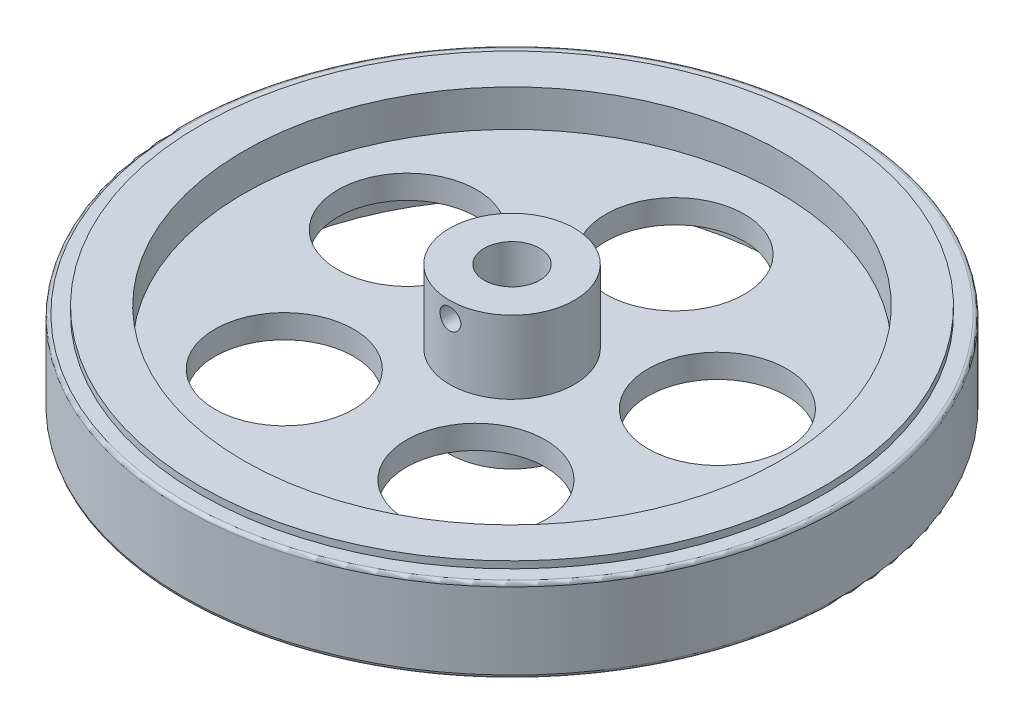
ISO-10303-21;
HEADER;
FILE_DESCRIPTION(('STEP AP214'),'2;1');
FILE_NAME('part.step','',(''),(''),'','','');
FILE_SCHEMA(('AUTOMOTIVE_DESIGN { 1 0 10303 214 1 1 1 1 }'));
ENDSEC;
DATA;
#1=APPLICATION_CONTEXT('core data for automotive mechanical design processes');
#2=APPLICATION_PROTOCOL_DEFINITION('international standard','automotive_design',2000,#1);
#3=PRODUCT_CONTEXT('',#1,'mechanical');
#4=PRODUCT('Part','Part','',(#3));
#5=PRODUCT_RELATED_PRODUCT_CATEGORY('part','',(#4));
#6=PRODUCT_DEFINITION_FORMATION('','',#4);
#7=PRODUCT_DEFINITION_CONTEXT('part definition',#1,'design');
#8=PRODUCT_DEFINITION('design','',#6,#7);
#9=PRODUCT_DEFINITION_SHAPE('','',#8);
#10=(LENGTH_UNIT() NAMED_UNIT(*) SI_UNIT(.MILLI.,.METRE.));
#11=(NAMED_UNIT(*) PLANE_ANGLE_UNIT() SI_UNIT($,.RADIAN.));
#12=(NAMED_UNIT(*) SI_UNIT($,.STERADIAN.) SOLID_ANGLE_UNIT());
#13=UNCERTAINTY_MEASURE_WITH_UNIT(LENGTH_MEASURE(1.E-05),#10,'distance_accuracy_value','');
#14=(GEOMETRIC_REPRESENTATION_CONTEXT(3) GLOBAL_UNCERTAINTY_ASSIGNED_CONTEXT((#13)) GLOBAL_UNIT_ASSIGNED_CONTEXT((#10,
#11,#12)) REPRESENTATION_CONTEXT('',''));
#15=CARTESIAN_POINT('',(0.,0.,0.));
#16=DIRECTION('',(0.,0.,1.));
#17=DIRECTION('',(1.,0.,0.));
#18=AXIS2_PLACEMENT_3D('',#15,#16,#17);
#19=CARTESIAN_POINT('',(0.,7.,0.));
#20=DIRECTION('',(0.,-1.,0.));
#21=DIRECTION('',(0.,0.,-1.));
#22=AXIS2_PLACEMENT_3D('',#19,#20,#21);
#23=CYLINDRICAL_SURFACE('',#22,4.);
#24=CARTESIAN_POINT('',(0.,12.2,0.));
#25=DIRECTION('',(0.,1.,0.));
#26=DIRECTION('',(0.,0.,1.));
#27=AXIS2_PLACEMENT_3D('',#24,#25,#26);
#28=CIRCLE('',#27,4.);
#29=CARTESIAN_POINT('',(0.,12.2,4.));
#30=VERTEX_POINT('',#29);
#31=EDGE_CURVE('E127',#30,#30,#28,.T.);
#32=ORIENTED_EDGE('',*,*,#31,.T.);
#33=EDGE_LOOP('',(#32));
#34=FACE_BOUND('',#33,.T.);
#35=CARTESIAN_POINT('',(0.,-7.,0.));
#36=DIRECTION('',(0.,1.,0.));
#37=DIRECTION('',(0.,0.,1.));
#38=AXIS2_PLACEMENT_3D('',#35,#36,#37);
#39=CIRCLE('',#38,4.);
#40=CARTESIAN_POINT('',(0.,-7.,4.));
#41=VERTEX_POINT('',#40);
#42=EDGE_CURVE('E58',#41,#41,#39,.T.);
#43=ORIENTED_EDGE('',*,*,#42,.F.);
#44=EDGE_LOOP('',(#43));
#45=FACE_BOUND('',#44,.T.);
#46=CARTESIAN_POINT('',(-1.5,9.9,3.70809924354783));
#47=CARTESIAN_POINT('',(-1.50000304106109,9.81899251627921,3.70809640633806));
#48=CARTESIAN_POINT('',(-1.49341597549487,9.73800507749636,3.71078260240986));
#49=CARTESIAN_POINT('',(-1.46736187895468,9.5784719170868,3.72116159304967));
#50=CARTESIAN_POINT('',(-1.44789523373263,9.49992612240499,3.72885423767112));
#51=CARTESIAN_POINT('',(-1.39689657610574,9.34762462838647,3.748254802809));
#52=CARTESIAN_POINT('',(-1.36539347266348,9.27385794334892,3.7599530956926));
#53=CARTESIAN_POINT('',(-1.29131856742698,9.13262810318116,3.78603134206598));
#54=CARTESIAN_POINT('',(-1.24874344095039,9.06516684971748,3.80041210067323));
#55=CARTESIAN_POINT('',(-1.15146661374162,8.93510968837718,3.83103574665713));
#56=CARTESIAN_POINT('',(-1.09630381213306,8.8728714703706,3.84733341923603));
#57=CARTESIAN_POINT('',(-0.976395839778926,8.75827718532851,3.87949750628547));
#58=CARTESIAN_POINT('',(-0.911648630256679,8.70592322625814,3.89536382814785));
#59=CARTESIAN_POINT('',(-0.771694655177599,8.61086048770439,3.92552873936553));
#60=CARTESIAN_POINT('',(-0.696206947538027,8.56854052528414,3.93975561223505));
#61=CARTESIAN_POINT('',(-0.538555771965247,8.49734882747509,3.96438007973848));
#62=CARTESIAN_POINT('',(-0.456394630933535,8.46847242800802,3.97477900217006));
#63=CARTESIAN_POINT('',(-0.291489341676832,8.42624210422538,3.9901869710344));
#64=CARTESIAN_POINT('',(-0.208923197281596,8.41227237255954,3.99540915214774));
#65=CARTESIAN_POINT('',(-0.0424643637947861,8.39827879905501,4.0006401410794));
#66=CARTESIAN_POINT('',(0.0414278850628329,8.39825042238129,4.00065064414902));
#67=CARTESIAN_POINT('',(0.203743543064476,8.41178176146517,3.99559265903894));
#68=CARTESIAN_POINT('',(0.2822321782669,8.42466929794881,3.99077541996683));
#69=CARTESIAN_POINT('',(0.435839217984391,8.46253591522555,3.97693274932263));
#70=CARTESIAN_POINT('',(0.510957383430298,8.48751585226204,3.96790701975578));
#71=CARTESIAN_POINT('',(0.656989017303104,8.54917045167585,3.94637769167531));
#72=CARTESIAN_POINT('',(0.727825392287309,8.58601000526841,3.93382539470077));
#73=CARTESIAN_POINT('',(0.862486607957559,8.67019209692939,3.90651310225279));
#74=CARTESIAN_POINT('',(0.926309176932323,8.7175380230176,3.8917523951284));
#75=CARTESIAN_POINT('',(1.04909048680094,8.82462728628319,3.86052529655816));
#76=CARTESIAN_POINT('',(1.10754614526348,8.88493391565043,3.84400963763883));
#77=CARTESIAN_POINT('',(1.21370395569342,9.01459299332156,3.81182460645722));
#78=CARTESIAN_POINT('',(1.261403406929,9.08394770658664,3.79615544748847));
#79=CARTESIAN_POINT('',(1.34565611808151,9.23171946746282,3.76712703500335));
#80=CARTESIAN_POINT('',(1.38193847851831,9.31030349368607,3.75382677150277));
#81=CARTESIAN_POINT('',(1.44056464441501,9.47309622516757,3.73172438629002));
#82=CARTESIAN_POINT('',(1.46291620605595,9.55730177159369,3.72291976205783));
#83=CARTESIAN_POINT('',(1.49190191709668,9.72397596231595,3.71139597222848));
#84=CARTESIAN_POINT('',(1.49933521158966,9.80628410553614,3.70836785241537));
#85=CARTESIAN_POINT('',(1.50057885636272,9.97100935674174,3.70786539525016));
#86=CARTESIAN_POINT('',(1.49439261093762,10.0534264323525,3.71038967003987));
#87=CARTESIAN_POINT('',(1.46929733520157,10.2119299222877,3.72039381629735));
#88=CARTESIAN_POINT('',(1.45100618334225,10.2881311357647,3.72763276216449));
#89=CARTESIAN_POINT('',(1.40299774640638,10.4363479447202,3.74596487046362));
#90=CARTESIAN_POINT('',(1.37327812034623,10.5083626791681,3.75705882250173));
#91=CARTESIAN_POINT('',(1.30200292275278,10.6491644380762,3.7823624311608));
#92=CARTESIAN_POINT('',(1.26004545177047,10.7177292921373,3.79667328892065));
#93=CARTESIAN_POINT('',(1.16591317862479,10.847128981726,3.82662814294291));
#94=CARTESIAN_POINT('',(1.11373463696435,10.9079609746246,3.84227262594077));
#95=CARTESIAN_POINT('',(0.996727340900939,11.0241683731951,3.87433046553184));
#96=CARTESIAN_POINT('',(0.931306341491062,11.0789534087687,3.89072969357028));
#97=CARTESIAN_POINT('',(0.791797471753152,11.1768383675894,3.92149874963302));
#98=CARTESIAN_POINT('',(0.717709573322675,11.2199382529458,3.93586857107664));
#99=CARTESIAN_POINT('',(0.563016329468479,11.2929460561996,3.96094985704552));
#100=CARTESIAN_POINT('',(0.482434433064628,11.3228991237926,3.9716738133801));
#101=CARTESIAN_POINT('',(0.316881887523256,11.3686564138499,3.98829436712571));
#102=CARTESIAN_POINT('',(0.231913320723594,11.3844672854224,3.99419323299412));
#103=CARTESIAN_POINT('',(0.065335585273817,11.4007744027548,4.00028407317073));
#104=CARTESIAN_POINT('',(-0.016180768060844,11.402109483059,4.00078860953764));
#105=CARTESIAN_POINT('',(-0.178226786412422,11.3915848405546,3.99684889809224));
#106=CARTESIAN_POINT('',(-0.258756569245256,11.3797267091141,3.9924052471313));
#107=CARTESIAN_POINT('',(-0.414548248377124,11.3437411485064,3.97921089603771));
#108=CARTESIAN_POINT('',(-0.489890731068833,11.3199200941216,3.97056791378017));
#109=CARTESIAN_POINT('',(-0.635515473006388,11.2609899866156,3.9498778362099));
#110=CARTESIAN_POINT('',(-0.705796771275541,11.2258787966952,3.93783009655664));
#111=CARTESIAN_POINT('',(-0.842540176994411,11.1436860564952,3.91090618300074));
#112=CARTESIAN_POINT('',(-0.908717548846847,11.0961633594859,3.89593240108828));
#113=CARTESIAN_POINT('',(-1.03241734752336,10.9911921698124,3.86499507694844));
#114=CARTESIAN_POINT('',(-1.0899366712559,10.9337401341921,3.84903118274027));
#115=CARTESIAN_POINT('',(-1.19781214236195,10.8069358683549,3.81688129739175));
#116=CARTESIAN_POINT('',(-1.24762999816025,10.7371155978457,3.8007280534916));
#117=CARTESIAN_POINT('',(-1.33484709556843,10.5895841304267,3.77098325003638));
#118=CARTESIAN_POINT('',(-1.37224504878157,10.5118721159465,3.75739195631216));
#119=CARTESIAN_POINT('',(-1.4346588697426,10.3470443190246,3.73402269853266));
#120=CARTESIAN_POINT('',(-1.45906002899523,10.2596656334882,3.7244380329086));
#121=CARTESIAN_POINT('',(-1.49172356722079,10.0815147280442,3.71147994336315));
#122=CARTESIAN_POINT('',(-1.4999965933957,9.99074478729001,3.70810242179736));
#123=CARTESIAN_POINT('',(-1.5,9.9,3.70809924354783));
#124=B_SPLINE_CURVE_WITH_KNOTS('',3,(#46,#47,#48,#49,#50,#51,#52,#53,#54,#55,#56,#57,#58,#59,
#60,#61,#62,#63,#64,#65,#66,#67,#68,#69,#70,#71,#72,#73,#74,#75,#76,#77,#78,#79,#80,#81,#82,#83,
#84,#85,#86,#87,#88,#89,#90,#91,#92,#93,#94,#95,#96,#97,#98,#99,#100,#101,#102,#103,#104,#105,
#106,#107,#108,#109,#110,#111,#112,#113,#114,#115,#116,#117,#118,#119,#120,#121,#122,#123),
.UNSPECIFIED.,.T.,.F.,(4,2,2,2,2,2,2,2,2,2,2,2,2,2,2,2,2,2,2,2,2,2,2,2,2,2,2,2,2,2,2,2,2,2,2,2,
2,2,4),(0.,0.242684541416169,0.485361814598854,0.727459856757029,0.969630679682932,
1.22274652401128,1.47591628822983,1.73770072136421,1.9993942638133,2.24980018489679,
2.50012465404857,2.73806472803194,2.97602165263335,3.21744131210668,3.45893893628976,
3.71456675065874,3.97025867827334,4.23162592252966,4.49284751635474,4.73965657740485,
4.98640395388884,5.22143845928198,5.45652113429526,5.70041561005821,5.94439948466355,
6.20385016993624,6.46330169650177,6.72185508890168,6.98028685560126,7.22365720549936,
7.46699820319479,7.7044027400389,7.94185223512831,8.18928323676986,8.43680270894964,
8.69738599542079,8.95799630544242,9.23003178870926,9.50188762323053),.UNSPECIFIED.);
#125=CARTESIAN_POINT('',(-1.5,9.9,3.70809924354783));
#126=VERTEX_POINT('',#125);
#127=EDGE_CURVE('E130',#126,#126,#124,.T.);
#128=ORIENTED_EDGE('',*,*,#127,.T.);
#129=EDGE_LOOP('',(#128));
#130=FACE_BOUND('',#129,.T.);
#131=ADVANCED_FACE('F34',(#34,#45,#130),#23,.F.);
#132=CARTESIAN_POINT('',(0.,1.7,0.));
#133=DIRECTION('',(0.,1.,0.));
#134=DIRECTION('',(0.,0.,1.));
#135=AXIS2_PLACEMENT_3D('',#132,#133,#134);
#136=CYLINDRICAL_SURFACE('',#135,9.);
#137=CARTESIAN_POINT('',(0.,12.2,0.));
#138=DIRECTION('',(0.,1.,0.));
#139=DIRECTION('',(0.,0.,1.));
#140=AXIS2_PLACEMENT_3D('',#137,#138,#139);
#141=CIRCLE('',#140,9.);
#142=CARTESIAN_POINT('',(0.,12.2,9.));
#143=VERTEX_POINT('',#142);
#144=EDGE_CURVE('E117',#143,#143,#141,.T.);
#145=ORIENTED_EDGE('',*,*,#144,.F.);
#146=EDGE_LOOP('',(#145));
#147=FACE_BOUND('',#146,.T.);
#148=CARTESIAN_POINT('',(0.,1.7,0.));
#149=DIRECTION('',(0.,1.,0.));
#150=DIRECTION('',(0.,0.,1.));
#151=AXIS2_PLACEMENT_3D('',#148,#149,#150);
#152=CIRCLE('',#151,9.);
#153=CARTESIAN_POINT('',(0.,1.7,9.));
#154=VERTEX_POINT('',#153);
#155=EDGE_CURVE('E95',#154,#154,#152,.T.);
#156=ORIENTED_EDGE('',*,*,#155,.T.);
#157=EDGE_LOOP('',(#156));
#158=FACE_BOUND('',#157,.T.);
#159=CARTESIAN_POINT('',(0.,8.4,9.));
#160=CARTESIAN_POINT('',(-0.0836345429749289,8.40000335336869,8.99999856701294));
#161=CARTESIAN_POINT('',(-0.167314729103292,8.40701836498135,8.9988220674782));
#162=CARTESIAN_POINT('',(-0.332328133003826,8.4348813952592,8.99424206964832));
#163=CARTESIAN_POINT('',(-0.413659120775548,8.45574213414696,8.99083652354334));
#164=CARTESIAN_POINT('',(-0.571562848327586,8.51064926915565,8.9821804094187));
#165=CARTESIAN_POINT('',(-0.64813942105914,8.54468487938434,8.97693135095516));
#166=CARTESIAN_POINT('',(-0.794485105186767,8.62494737523144,8.96516536249242));
#167=CARTESIAN_POINT('',(-0.864254993927154,8.6711728664898,8.9586485775266));
#168=CARTESIAN_POINT('',(-0.995683568575008,8.77497305029228,8.94499990474988));
#169=CARTESIAN_POINT('',(-1.05726774212098,8.83264146878168,8.93786323088914));
#170=CARTESIAN_POINT('',(-1.16993309919596,8.95748878108368,8.92381576126039));
#171=CARTESIAN_POINT('',(-1.22101361963458,9.02466827487397,8.916904979776));
#172=CARTESIAN_POINT('',(-1.31152027536308,9.16714257971823,8.90404539455868));
#173=CARTESIAN_POINT('',(-1.3508727317166,9.24248480208285,8.89810277454982));
#174=CARTESIAN_POINT('',(-1.41633501924673,9.39882573858038,8.88791873876805));
#175=CARTESIAN_POINT('',(-1.44244574493937,9.47982407020658,8.88367720808584));
#176=CARTESIAN_POINT('',(-1.48044862667088,9.64438816491392,8.87742322105653));
#177=CARTESIAN_POINT('',(-1.49246941748124,9.72792344190083,8.8753906109142));
#178=CARTESIAN_POINT('',(-1.50235003517392,9.89584816613008,8.87372363361989));
#179=CARTESIAN_POINT('',(-1.5002108642334,9.98023755250038,8.87408909674328));
#180=CARTESIAN_POINT('',(-1.48193705903769,10.1465567167653,8.87715857318133));
#181=CARTESIAN_POINT('',(-1.46594692913386,10.2285028821271,8.8798384399135));
#182=CARTESIAN_POINT('',(-1.42065188424207,10.3885327906975,8.88719697126605));
#183=CARTESIAN_POINT('',(-1.39134651259184,10.4666164013331,8.89187570443963));
#184=CARTESIAN_POINT('',(-1.32010634765635,10.6171372940646,8.9027308760046));
#185=CARTESIAN_POINT('',(-1.27811154832783,10.6895456436487,8.90891440264395));
#186=CARTESIAN_POINT('',(-1.18272721053446,10.826342640323,8.92207751049005));
#187=CARTESIAN_POINT('',(-1.12933675239257,10.890730639473,8.92905715592572));
#188=CARTESIAN_POINT('',(-1.01188932729543,11.0104956514844,8.94313216727871));
#189=CARTESIAN_POINT('',(-0.947708378323875,11.065751111124,8.95022789538991));
#190=CARTESIAN_POINT('',(-0.810921149388987,11.1647266575992,8.96365560838034));
#191=CARTESIAN_POINT('',(-0.738314815143852,11.2084466701099,8.96998758833847));
#192=CARTESIAN_POINT('',(-0.586623549700026,11.2831213362818,8.98118335735747));
#193=CARTESIAN_POINT('',(-0.507533235338796,11.3140652515988,8.98604591044468));
#194=CARTESIAN_POINT('',(-0.345179007361638,11.3621965291476,8.99374501807596));
#195=CARTESIAN_POINT('',(-0.26191544350768,11.3793850421842,8.99658174210284));
#196=CARTESIAN_POINT('',(-0.0946259407809731,11.3993528150767,8.99988677905612));
#197=CARTESIAN_POINT('',(-0.0106204422906058,11.4022989430834,9.00038251807671));
#198=CARTESIAN_POINT('',(0.156683863733933,11.3941431933431,8.99902484652702));
#199=CARTESIAN_POINT('',(0.239982698335224,11.3830418561198,8.99717152634471));
#200=CARTESIAN_POINT('',(0.402993705328059,11.3472450903987,8.99134096162921));
#201=CARTESIAN_POINT('',(0.482724521031229,11.3226322749659,8.98737662880787));
#202=CARTESIAN_POINT('',(0.636928130916267,11.2605992890803,8.97776678673215));
#203=CARTESIAN_POINT('',(0.711400629545832,11.2231783994188,8.97212118307212));
#204=CARTESIAN_POINT('',(0.853698413681376,11.1362093251819,8.95970709781444));
#205=CARTESIAN_POINT('',(0.921459150562289,11.0865569062996,8.95292913532213));
#206=CARTESIAN_POINT('',(1.04774615130161,10.976677610769,8.93903080435141));
#207=CARTESIAN_POINT('',(1.10627174381795,10.916449966034,8.93191041102928));
#208=CARTESIAN_POINT('',(1.2130456677948,10.7863814711571,8.91804105141507));
#209=CARTESIAN_POINT('',(1.26118125666823,10.7164475006914,8.91129669682264));
#210=CARTESIAN_POINT('',(1.34502138617699,10.5693882185169,8.8990291786673));
#211=CARTESIAN_POINT('',(1.38072632086189,10.4922631348635,8.89350597639612));
#212=CARTESIAN_POINT('',(1.43852299888389,10.3333261603127,8.88434072218623));
#213=CARTESIAN_POINT('',(1.46067085952877,10.2515351429817,8.88069092586639));
#214=CARTESIAN_POINT('',(1.49090127226697,10.0853279224669,8.87566630101156));
#215=CARTESIAN_POINT('',(1.4989850471677,10.0009119481608,8.87429127469633));
#216=CARTESIAN_POINT('',(1.50082371962841,9.83297690042255,8.87398039850407));
#217=CARTESIAN_POINT('',(1.49475608167511,9.74945977285483,8.8750143390339));
#218=CARTESIAN_POINT('',(1.46884790337411,9.58465245116954,8.87933868872237));
#219=CARTESIAN_POINT('',(1.44900740766749,9.50336224983488,8.88262909056728));
#220=CARTESIAN_POINT('',(1.39618469375694,9.34538493762443,8.89108413769031));
#221=CARTESIAN_POINT('',(1.36321775436027,9.26869259396638,8.89624660331802));
#222=CARTESIAN_POINT('',(1.28509620234955,9.12189859848309,8.90786621353324));
#223=CARTESIAN_POINT('',(1.23994098524914,9.05179727377672,8.91432342233039));
#224=CARTESIAN_POINT('',(1.13809133062329,8.91927865013535,8.92790072427373));
#225=CARTESIAN_POINT('',(1.08126633815619,8.85696238997983,8.93502777345781));
#226=CARTESIAN_POINT('',(0.957965418828137,8.74268903731504,8.94908623416505));
#227=CARTESIAN_POINT('',(0.891487267747581,8.6907343388171,8.95601760015928));
#228=CARTESIAN_POINT('',(0.750221501784168,8.59833103908003,8.96895917785332));
#229=CARTESIAN_POINT('',(0.67537967251969,8.55796437641223,8.97496269751862));
#230=CARTESIAN_POINT('',(0.519907841627388,8.49043830923405,8.98530700561065));
#231=CARTESIAN_POINT('',(0.439283696898005,8.46326575135218,8.98964944906489));
#232=CARTESIAN_POINT('',(0.29862198602724,8.428796835524,8.99523474499773));
#233=CARTESIAN_POINT('',(0.239435298179069,8.41801531823042,8.99701216364015));
#234=CARTESIAN_POINT('',(0.120173586191886,8.40361575729315,8.99939529591672));
#235=CARTESIAN_POINT('',(0.0600985773650968,8.39999759031758,9.00000102972385));
#236=CARTESIAN_POINT('',(0.,8.4,9.));
#237=B_SPLINE_CURVE_WITH_KNOTS('',3,(#159,#160,#161,#162,#163,#164,#165,#166,#167,#168,#169,
#170,#171,#172,#173,#174,#175,#176,#177,#178,#179,#180,#181,#182,#183,#184,#185,#186,#187,#188,
#189,#190,#191,#192,#193,#194,#195,#196,#197,#198,#199,#200,#201,#202,#203,#204,#205,#206,#207,
#208,#209,#210,#211,#212,#213,#214,#215,#216,#217,#218,#219,#220,#221,#222,#223,#224,#225,#226,
#227,#228,#229,#230,#231,#232,#233,#234,#235,#236),.UNSPECIFIED.,.T.,.F.,(4,2,2,2,2,2,2,2,2,2,2,
2,2,2,2,2,2,2,2,2,2,2,2,2,2,2,2,2,2,2,2,2,2,2,2,2,2,2,4),(0.,0.250683950963106,
0.501598527417252,0.752308120215162,1.00298904760487,1.25581494637399,1.50865680101914,
1.76305512494304,2.01743626125709,2.26947646262054,2.52149882592532,2.77092313056245,
3.02035599015229,3.27098733979535,3.52163892408344,3.77539661946796,4.02915594981509,
4.28312813349542,4.53707906712689,4.78804730094838,5.03900587821516,5.28844684203849,
5.5379018149564,5.78956095376214,6.0412383783257,6.29552293204571,6.54979942425566,
6.80301613405063,7.05621082671971,7.3062474571362,7.5562832771288,7.80602890935733,
8.05578693017602,8.30850830516035,8.56128800327383,8.8158133896432,9.07008451278043,
9.25022548898411,9.43036336366181),.UNSPECIFIED.);
#238=CARTESIAN_POINT('',(0.,8.4,9.));
#239=VERTEX_POINT('',#238);
#240=EDGE_CURVE('E38',#239,#239,#237,.T.);
#241=ORIENTED_EDGE('',*,*,#240,.T.);
#242=EDGE_LOOP('',(#241));
#243=FACE_BOUND('',#242,.T.);
#244=ADVANCED_FACE('F181',(#147,#158,#243),#136,.T.);
#245=CARTESIAN_POINT('',(0.,-7.,0.));
#246=DIRECTION('',(0.,1.,0.));
#247=DIRECTION('',(0.,0.,1.));
#248=AXIS2_PLACEMENT_3D('',#245,#246,#247);
#249=PLANE('',#248);
#250=ORIENTED_EDGE('',*,*,#42,.T.);
#251=EDGE_LOOP('',(#250));
#252=FACE_BOUND('',#251,.T.);
#253=CARTESIAN_POINT('',(0.,-7.,0.));
#254=DIRECTION('',(0.,1.,0.));
#255=DIRECTION('',(0.,0.,1.));
#256=AXIS2_PLACEMENT_3D('',#253,#254,#255);
#257=CIRCLE('',#256,9.);
#258=CARTESIAN_POINT('',(0.,-7.,9.));
#259=VERTEX_POINT('',#258);
#260=EDGE_CURVE('E76',#259,#259,#257,.T.);
#261=ORIENTED_EDGE('',*,*,#260,.F.);
#262=EDGE_LOOP('',(#261));
#263=FACE_BOUND('',#262,.T.);
#264=ADVANCED_FACE('F185',(#252,#263),#249,.F.);
#265=CARTESIAN_POINT('',(0.,7.,0.));
#266=DIRECTION('',(0.,-1.,0.));
#267=DIRECTION('',(0.,0.,-1.));
#268=AXIS2_PLACEMENT_3D('',#265,#266,#267);
#269=CYLINDRICAL_SURFACE('',#268,47.5);
#270=CARTESIAN_POINT('',(0.,-5.5,0.));
#271=DIRECTION('',(0.,-1.,0.));
#272=DIRECTION('',(0.,0.,-1.));
#273=AXIS2_PLACEMENT_3D('',#270,#271,#272);
#274=CIRCLE('',#273,47.5);
#275=CARTESIAN_POINT('',(0.,-5.5,-47.5));
#276=VERTEX_POINT('',#275);
#277=EDGE_CURVE('E50',#276,#276,#274,.F.);
#278=ORIENTED_EDGE('',*,*,#277,.T.);
#279=EDGE_LOOP('',(#278));
#280=FACE_BOUND('',#279,.T.);
#281=CARTESIAN_POINT('',(0.,5.5,0.));
#282=DIRECTION('',(0.,1.,0.));
#283=DIRECTION('',(0.,0.,1.));
#284=AXIS2_PLACEMENT_3D('',#281,#282,#283);
#285=CIRCLE('',#284,47.5);
#286=CARTESIAN_POINT('',(0.,5.5,47.5));
#287=VERTEX_POINT('',#286);
#288=EDGE_CURVE('E55',#287,#287,#285,.F.);
#289=ORIENTED_EDGE('',*,*,#288,.T.);
#290=EDGE_LOOP('',(#289));
#291=FACE_BOUND('',#290,.T.);
#292=ADVANCED_FACE('F214',(#280,#291),#269,.T.);
#293=CARTESIAN_POINT('',(0.,-7.,0.));
#294=DIRECTION('',(0.,1.,0.));
#295=DIRECTION('',(0.,0.,1.));
#296=AXIS2_PLACEMENT_3D('',#293,#294,#295);
#297=CIRCLE('',#296,38.66);
#298=CARTESIAN_POINT('',(0.,-7.,38.66));
#299=VERTEX_POINT('',#298);
#300=EDGE_CURVE('E101',#299,#299,#297,.T.);
#301=ORIENTED_EDGE('',*,*,#300,.T.);
#302=EDGE_LOOP('',(#301));
#303=FACE_BOUND('',#302,.T.);
#304=CARTESIAN_POINT('',(0.,-7.,0.));
#305=DIRECTION('',(0.,1.,0.));
#306=DIRECTION('',(0.,0.,1.));
#307=AXIS2_PLACEMENT_3D('',#304,#305,#306);
#308=CIRCLE('',#307,45.);
#309=CARTESIAN_POINT('',(0.,-7.,45.));
#310=VERTEX_POINT('',#309);
#311=EDGE_CURVE('E86',#310,#310,#308,.T.);
#312=ORIENTED_EDGE('',*,*,#311,.F.);
#313=EDGE_LOOP('',(#312));
#314=FACE_BOUND('',#313,.T.);
#315=ADVANCED_FACE('F211',(#303,#314),#249,.F.);
#316=CARTESIAN_POINT('',(0.,7.,0.));
#317=DIRECTION('',(0.,1.,0.));
#318=DIRECTION('',(0.,0.,1.));
#319=AXIS2_PLACEMENT_3D('',#316,#317,#318);
#320=PLANE('',#319);
#321=CARTESIAN_POINT('',(0.,7.,0.));
#322=DIRECTION('',(0.,1.,0.));
#323=DIRECTION('',(0.,0.,1.));
#324=AXIS2_PLACEMENT_3D('',#321,#322,#323);
#325=CIRCLE('',#324,38.66);
#326=CARTESIAN_POINT('',(0.,7.,38.66));
#327=VERTEX_POINT('',#326);
#328=EDGE_CURVE('E92',#327,#327,#325,.T.);
#329=ORIENTED_EDGE('',*,*,#328,.F.);
#330=EDGE_LOOP('',(#329));
#331=FACE_BOUND('',#330,.T.);
#332=CARTESIAN_POINT('',(0.,7.,0.));
#333=DIRECTION('',(0.,1.,0.));
#334=DIRECTION('',(0.,0.,1.));
#335=AXIS2_PLACEMENT_3D('',#332,#333,#334);
#336=CIRCLE('',#335,45.);
#337=CARTESIAN_POINT('',(0.,7.,45.));
#338=VERTEX_POINT('',#337);
#339=EDGE_CURVE('E80',#338,#338,#336,.T.);
#340=ORIENTED_EDGE('',*,*,#339,.T.);
#341=EDGE_LOOP('',(#340));
#342=FACE_BOUND('',#341,.T.);
#343=ADVANCED_FACE('F209',(#331,#342),#320,.T.);
#344=CARTESIAN_POINT('',(0.,6.,0.));
#345=DIRECTION('',(0.,1.,0.));
#346=DIRECTION('',(0.,0.,1.));
#347=AXIS2_PLACEMENT_3D('',#344,#345,#346);
#348=PLANE('',#347);
#349=CARTESIAN_POINT('',(0.,6.,0.));
#350=DIRECTION('',(0.,1.,0.));
#351=DIRECTION('',(0.,0.,1.));
#352=AXIS2_PLACEMENT_3D('',#349,#350,#351);
#353=CIRCLE('',#352,47.);
#354=CARTESIAN_POINT('',(0.,6.,47.));
#355=VERTEX_POINT('',#354);
#356=EDGE_CURVE('E10',#355,#355,#353,.T.);
#357=ORIENTED_EDGE('',*,*,#356,.T.);
#358=EDGE_LOOP('',(#357));
#359=FACE_BOUND('',#358,.T.);
#360=CARTESIAN_POINT('',(0.,6.,0.));
#361=DIRECTION('',(0.,1.,0.));
#362=DIRECTION('',(0.,0.,1.));
#363=AXIS2_PLACEMENT_3D('',#360,#361,#362);
#364=CIRCLE('',#363,45.);
#365=CARTESIAN_POINT('',(0.,6.,45.));
#366=VERTEX_POINT('',#365);
#367=EDGE_CURVE('E79',#366,#366,#364,.T.);
#368=ORIENTED_EDGE('',*,*,#367,.F.);
#369=EDGE_LOOP('',(#368));
#370=FACE_BOUND('',#369,.T.);
#371=ADVANCED_FACE('F205',(#359,#370),#348,.T.);
#372=CARTESIAN_POINT('',(0.,6.,0.));
#373=DIRECTION('',(0.,1.,0.));
#374=DIRECTION('',(0.,0.,1.));
#375=AXIS2_PLACEMENT_3D('',#372,#373,#374);
#376=CYLINDRICAL_SURFACE('',#375,45.);
#377=ORIENTED_EDGE('',*,*,#367,.T.);
#378=EDGE_LOOP('',(#377));
#379=FACE_BOUND('',#378,.T.);
#380=ORIENTED_EDGE('',*,*,#339,.F.);
#381=EDGE_LOOP('',(#380));
#382=FACE_BOUND('',#381,.T.);
#383=ADVANCED_FACE('F201',(#379,#382),#376,.T.);
#384=CARTESIAN_POINT('',(0.,-6.,0.));
#385=DIRECTION('',(0.,-1.,0.));
#386=DIRECTION('',(0.,0.,1.));
#387=AXIS2_PLACEMENT_3D('',#384,#385,#386);
#388=PLANE('',#387);
#389=CARTESIAN_POINT('',(0.,-6.,0.));
#390=DIRECTION('',(0.,-1.,0.));
#391=DIRECTION('',(0.,0.,-1.));
#392=AXIS2_PLACEMENT_3D('',#389,#390,#391);
#393=CIRCLE('',#392,47.);
#394=CARTESIAN_POINT('',(0.,-6.,-47.));
#395=VERTEX_POINT('',#394);
#396=EDGE_CURVE('E46',#395,#395,#393,.T.);
#397=ORIENTED_EDGE('',*,*,#396,.T.);
#398=EDGE_LOOP('',(#397));
#399=FACE_BOUND('',#398,.T.);
#400=CARTESIAN_POINT('',(0.,-6.,0.));
#401=DIRECTION('',(0.,1.,0.));
#402=DIRECTION('',(0.,0.,1.));
#403=AXIS2_PLACEMENT_3D('',#400,#401,#402);
#404=CIRCLE('',#403,45.);
#405=CARTESIAN_POINT('',(0.,-6.,45.));
#406=VERTEX_POINT('',#405);
#407=EDGE_CURVE('E83',#406,#406,#404,.T.);
#408=ORIENTED_EDGE('',*,*,#407,.T.);
#409=EDGE_LOOP('',(#408));
#410=FACE_BOUND('',#409,.T.);
#411=ADVANCED_FACE('F197',(#399,#410),#388,.T.);
#412=CARTESIAN_POINT('',(0.,-6.,0.));
#413=DIRECTION('',(0.,-1.,0.));
#414=DIRECTION('',(0.,0.,-1.));
#415=AXIS2_PLACEMENT_3D('',#412,#413,#414);
#416=CYLINDRICAL_SURFACE('',#415,45.);
#417=ORIENTED_EDGE('',*,*,#407,.F.);
#418=EDGE_LOOP('',(#417));
#419=FACE_BOUND('',#418,.T.);
#420=ORIENTED_EDGE('',*,*,#311,.T.);
#421=EDGE_LOOP('',(#420));
#422=FACE_BOUND('',#421,.T.);
#423=ADVANCED_FACE('F193',(#419,#422),#416,.T.);
#424=CARTESIAN_POINT('',(0.,1.7,0.));
#425=DIRECTION('',(0.,1.,0.));
#426=DIRECTION('',(0.,0.,1.));
#427=AXIS2_PLACEMENT_3D('',#424,#425,#426);
#428=CYLINDRICAL_SURFACE('',#427,38.66);
#429=CARTESIAN_POINT('',(0.,1.7,0.));
#430=DIRECTION('',(0.,1.,0.));
#431=DIRECTION('',(0.,0.,1.));
#432=AXIS2_PLACEMENT_3D('',#429,#430,#431);
#433=CIRCLE('',#432,38.66);
#434=CARTESIAN_POINT('',(0.,1.7,38.66));
#435=VERTEX_POINT('',#434);
#436=EDGE_CURVE('E89',#435,#435,#433,.T.);
#437=ORIENTED_EDGE('',*,*,#436,.F.);
#438=EDGE_LOOP('',(#437));
#439=FACE_BOUND('',#438,.T.);
#440=ORIENTED_EDGE('',*,*,#328,.T.);
#441=EDGE_LOOP('',(#440));
#442=FACE_BOUND('',#441,.T.);
#443=ADVANCED_FACE('F189',(#439,#442),#428,.F.);
#444=CARTESIAN_POINT('',(0.,1.7,0.));
#445=DIRECTION('',(0.,1.,0.));
#446=DIRECTION('',(0.,0.,1.));
#447=AXIS2_PLACEMENT_3D('',#444,#445,#446);
#448=PLANE('',#447);
#449=CARTESIAN_POINT('',(22.3498281329368,1.7,-7.26189936781222));
#450=DIRECTION('',(0.,1.,0.));
#451=DIRECTION('',(0.,0.,1.));
#452=AXIS2_PLACEMENT_3D('',#449,#450,#451);
#453=CIRCLE('',#452,10.0000000000005);
#454=CARTESIAN_POINT('',(22.3498281329368,1.7,2.73810063218824));
#455=VERTEX_POINT('',#454);
#456=EDGE_CURVE('E72',#455,#455,#453,.T.);
#457=ORIENTED_EDGE('',*,*,#456,.F.);
#458=EDGE_LOOP('',(#457));
#459=FACE_BOUND('',#458,.T.);
#460=CARTESIAN_POINT('',(13.8129534288749,1.7,19.0118993678107));
#461=DIRECTION('',(0.,1.,0.));
#462=DIRECTION('',(0.,0.,1.));
#463=AXIS2_PLACEMENT_3D('',#460,#461,#462);
#464=CIRCLE('',#463,10.0000000000017);
#465=CARTESIAN_POINT('',(13.8129534288749,1.7,29.0118993678124));
#466=VERTEX_POINT('',#465);
#467=EDGE_CURVE('E120',#466,#466,#464,.T.);
#468=ORIENTED_EDGE('',*,*,#467,.F.);
#469=EDGE_LOOP('',(#468));
#470=FACE_BOUND('',#469,.T.);
#471=CARTESIAN_POINT('',(-13.8129534288713,1.7,19.0118993678119));
#472=DIRECTION('',(0.,1.,0.));
#473=DIRECTION('',(0.,0.,1.));
#474=AXIS2_PLACEMENT_3D('',#471,#472,#473);
#475=CIRCLE('',#474,10.0000000000021);
#476=CARTESIAN_POINT('',(-13.8129534288713,1.7,29.011899367814));
#477=VERTEX_POINT('',#476);
#478=EDGE_CURVE('E116',#477,#477,#475,.T.);
#479=ORIENTED_EDGE('',*,*,#478,.F.);
#480=EDGE_LOOP('',(#479));
#481=FACE_BOUND('',#480,.T.);
#482=CARTESIAN_POINT('',(-22.3498281329354,1.7,-7.26189936781031));
#483=DIRECTION('',(0.,1.,0.));
#484=DIRECTION('',(0.,0.,1.));
#485=AXIS2_PLACEMENT_3D('',#482,#483,#484);
#486=CIRCLE('',#485,10.0000000000012);
#487=CARTESIAN_POINT('',(-22.3498281329354,1.7,2.73810063219088));
#488=VERTEX_POINT('',#487);
#489=EDGE_CURVE('E113',#488,#488,#486,.T.);
#490=ORIENTED_EDGE('',*,*,#489,.F.);
#491=EDGE_LOOP('',(#490));
#492=FACE_BOUND('',#491,.T.);
#493=CARTESIAN_POINT('',(0.,1.7,-23.5));
#494=DIRECTION('',(0.,1.,0.));
#495=DIRECTION('',(0.,0.,1.));
#496=AXIS2_PLACEMENT_3D('',#493,#494,#495);
#497=CIRCLE('',#496,10.);
#498=CARTESIAN_POINT('',(0.,1.7,-13.5));
#499=VERTEX_POINT('',#498);
#500=EDGE_CURVE('E62',#499,#499,#497,.T.);
#501=ORIENTED_EDGE('',*,*,#500,.F.);
#502=EDGE_LOOP('',(#501));
#503=FACE_BOUND('',#502,.T.);
#504=ORIENTED_EDGE('',*,*,#155,.F.);
#505=EDGE_LOOP('',(#504));
#506=FACE_BOUND('',#505,.T.);
#507=ORIENTED_EDGE('',*,*,#436,.T.);
#508=EDGE_LOOP('',(#507));
#509=FACE_BOUND('',#508,.T.);
#510=ADVANCED_FACE('F177',(#459,#470,#481,#492,#503,#506,#509),#448,.T.);
#511=CARTESIAN_POINT('',(0.,-1.7,0.));
#512=DIRECTION('',(0.,-1.,0.));
#513=DIRECTION('',(0.,0.,1.));
#514=AXIS2_PLACEMENT_3D('',#511,#512,#513);
#515=PLANE('',#514);
#516=CARTESIAN_POINT('',(22.3498281329368,-1.7,-7.26189936781222));
#517=DIRECTION('',(0.,-1.,0.));
#518=DIRECTION('',(0.,0.,-1.));
#519=AXIS2_PLACEMENT_3D('',#516,#517,#518);
#520=CIRCLE('',#519,10.0000000000005);
#521=CARTESIAN_POINT('',(22.3498281329368,-1.7,-17.2618993678127));
#522=VERTEX_POINT('',#521);
#523=EDGE_CURVE('E59',#522,#522,#520,.T.);
#524=ORIENTED_EDGE('',*,*,#523,.F.);
#525=EDGE_LOOP('',(#524));
#526=FACE_BOUND('',#525,.T.);
#527=CARTESIAN_POINT('',(13.8129534288749,-1.7,19.0118993678107));
#528=DIRECTION('',(0.,-1.,0.));
#529=DIRECTION('',(0.,0.,-1.));
#530=AXIS2_PLACEMENT_3D('',#527,#528,#529);
#531=CIRCLE('',#530,10.0000000000017);
#532=CARTESIAN_POINT('',(13.8129534288749,-1.7,9.01189936780899));
#533=VERTEX_POINT('',#532);
#534=EDGE_CURVE('E63',#533,#533,#531,.T.);
#535=ORIENTED_EDGE('',*,*,#534,.F.);
#536=EDGE_LOOP('',(#535));
#537=FACE_BOUND('',#536,.T.);
#538=CARTESIAN_POINT('',(-13.8129534288713,-1.7,19.0118993678119));
#539=DIRECTION('',(0.,-1.,0.));
#540=DIRECTION('',(0.,0.,-1.));
#541=AXIS2_PLACEMENT_3D('',#538,#539,#540);
#542=CIRCLE('',#541,10.0000000000021);
#543=CARTESIAN_POINT('',(-13.8129534288713,-1.7,9.01189936780975));
#544=VERTEX_POINT('',#543);
#545=EDGE_CURVE('E66',#544,#544,#542,.T.);
#546=ORIENTED_EDGE('',*,*,#545,.F.);
#547=EDGE_LOOP('',(#546));
#548=FACE_BOUND('',#547,.T.);
#549=CARTESIAN_POINT('',(-22.3498281329354,-1.7,-7.26189936781031));
#550=DIRECTION('',(0.,-1.,0.));
#551=DIRECTION('',(0.,0.,-1.));
#552=AXIS2_PLACEMENT_3D('',#549,#550,#551);
#553=CIRCLE('',#552,10.0000000000012);
#554=CARTESIAN_POINT('',(-22.3498281329354,-1.7,-17.2618993678115));
#555=VERTEX_POINT('',#554);
#556=EDGE_CURVE('E69',#555,#555,#553,.T.);
#557=ORIENTED_EDGE('',*,*,#556,.F.);
#558=EDGE_LOOP('',(#557));
#559=FACE_BOUND('',#558,.T.);
#560=CARTESIAN_POINT('',(0.,-1.7,-23.5));
#561=DIRECTION('',(0.,-1.,0.));
#562=DIRECTION('',(0.,0.,-1.));
#563=AXIS2_PLACEMENT_3D('',#560,#561,#562);
#564=CIRCLE('',#563,10.);
#565=CARTESIAN_POINT('',(0.,-1.7,-33.5));
#566=VERTEX_POINT('',#565);
#567=EDGE_CURVE('E73',#566,#566,#564,.T.);
#568=ORIENTED_EDGE('',*,*,#567,.F.);
#569=EDGE_LOOP('',(#568));
#570=FACE_BOUND('',#569,.T.);
#571=CARTESIAN_POINT('',(0.,-1.7,0.));
#572=DIRECTION('',(0.,1.,0.));
#573=DIRECTION('',(0.,0.,1.));
#574=AXIS2_PLACEMENT_3D('',#571,#572,#573);
#575=CIRCLE('',#574,38.66);
#576=CARTESIAN_POINT('',(0.,-1.7,38.66));
#577=VERTEX_POINT('',#576);
#578=EDGE_CURVE('E100',#577,#577,#575,.T.);
#579=ORIENTED_EDGE('',*,*,#578,.F.);
#580=EDGE_LOOP('',(#579));
#581=FACE_BOUND('',#580,.T.);
#582=CARTESIAN_POINT('',(0.,-1.7,0.));
#583=DIRECTION('',(0.,1.,0.));
#584=DIRECTION('',(0.,0.,1.));
#585=AXIS2_PLACEMENT_3D('',#582,#583,#584);
#586=CIRCLE('',#585,9.);
#587=CARTESIAN_POINT('',(0.,-1.7,9.));
#588=VERTEX_POINT('',#587);
#589=EDGE_CURVE('E104',#588,#588,#586,.T.);
#590=ORIENTED_EDGE('',*,*,#589,.T.);
#591=EDGE_LOOP('',(#590));
#592=FACE_BOUND('',#591,.T.);
#593=ADVANCED_FACE('F174',(#526,#537,#548,#559,#570,#581,#592),#515,.T.);
#594=CARTESIAN_POINT('',(0.,-1.7,0.));
#595=DIRECTION('',(0.,-1.,0.));
#596=DIRECTION('',(0.,0.,-1.));
#597=AXIS2_PLACEMENT_3D('',#594,#595,#596);
#598=CYLINDRICAL_SURFACE('',#597,38.66);
#599=ORIENTED_EDGE('',*,*,#578,.T.);
#600=EDGE_LOOP('',(#599));
#601=FACE_BOUND('',#600,.T.);
#602=ORIENTED_EDGE('',*,*,#300,.F.);
#603=EDGE_LOOP('',(#602));
#604=FACE_BOUND('',#603,.T.);
#605=ADVANCED_FACE('F172',(#601,#604),#598,.F.);
#606=CARTESIAN_POINT('',(0.,-1.7,0.));
#607=DIRECTION('',(0.,-1.,0.));
#608=DIRECTION('',(0.,0.,-1.));
#609=AXIS2_PLACEMENT_3D('',#606,#607,#608);
#610=CYLINDRICAL_SURFACE('',#609,9.);
#611=ORIENTED_EDGE('',*,*,#589,.F.);
#612=EDGE_LOOP('',(#611));
#613=FACE_BOUND('',#612,.T.);
#614=ORIENTED_EDGE('',*,*,#260,.T.);
#615=EDGE_LOOP('',(#614));
#616=FACE_BOUND('',#615,.T.);
#617=ADVANCED_FACE('F168',(#613,#616),#610,.T.);
#618=CARTESIAN_POINT('',(0.,-7.,-23.5));
#619=DIRECTION('',(0.,1.,0.));
#620=DIRECTION('',(0.,0.,1.));
#621=AXIS2_PLACEMENT_3D('',#618,#619,#620);
#622=CYLINDRICAL_SURFACE('',#621,10.);
#623=ORIENTED_EDGE('',*,*,#567,.T.);
#624=EDGE_LOOP('',(#623));
#625=FACE_BOUND('',#624,.T.);
#626=ORIENTED_EDGE('',*,*,#500,.T.);
#627=EDGE_LOOP('',(#626));
#628=FACE_BOUND('',#627,.T.);
#629=ADVANCED_FACE('F164',(#625,#628),#622,.F.);
#630=CARTESIAN_POINT('',(-22.3498281329354,-7.,-7.26189936781031));
#631=DIRECTION('',(0.,1.,0.));
#632=DIRECTION('',(0.,0.,1.));
#633=AXIS2_PLACEMENT_3D('',#630,#631,#632);
#634=CYLINDRICAL_SURFACE('',#633,10.0000000000012);
#635=ORIENTED_EDGE('',*,*,#556,.T.);
#636=EDGE_LOOP('',(#635));
#637=FACE_BOUND('',#636,.T.);
#638=ORIENTED_EDGE('',*,*,#489,.T.);
#639=EDGE_LOOP('',(#638));
#640=FACE_BOUND('',#639,.T.);
#641=ADVANCED_FACE('F160',(#637,#640),#634,.F.);
#642=CARTESIAN_POINT('',(-13.8129534288713,-7.,19.0118993678119));
#643=DIRECTION('',(0.,1.,0.));
#644=DIRECTION('',(0.,0.,1.));
#645=AXIS2_PLACEMENT_3D('',#642,#643,#644);
#646=CYLINDRICAL_SURFACE('',#645,10.0000000000021);
#647=ORIENTED_EDGE('',*,*,#545,.T.);
#648=EDGE_LOOP('',(#647));
#649=FACE_BOUND('',#648,.T.);
#650=ORIENTED_EDGE('',*,*,#478,.T.);
#651=EDGE_LOOP('',(#650));
#652=FACE_BOUND('',#651,.T.);
#653=ADVANCED_FACE('F156',(#649,#652),#646,.F.);
#654=CARTESIAN_POINT('',(13.8129534288749,-7.,19.0118993678107));
#655=DIRECTION('',(0.,1.,0.));
#656=DIRECTION('',(0.,0.,1.));
#657=AXIS2_PLACEMENT_3D('',#654,#655,#656);
#658=CYLINDRICAL_SURFACE('',#657,10.0000000000017);
#659=ORIENTED_EDGE('',*,*,#534,.T.);
#660=EDGE_LOOP('',(#659));
#661=FACE_BOUND('',#660,.T.);
#662=ORIENTED_EDGE('',*,*,#467,.T.);
#663=EDGE_LOOP('',(#662));
#664=FACE_BOUND('',#663,.T.);
#665=ADVANCED_FACE('F152',(#661,#664),#658,.F.);
#666=CARTESIAN_POINT('',(22.3498281329368,-7.,-7.26189936781222));
#667=DIRECTION('',(0.,1.,0.));
#668=DIRECTION('',(0.,0.,1.));
#669=AXIS2_PLACEMENT_3D('',#666,#667,#668);
#670=CYLINDRICAL_SURFACE('',#669,10.0000000000005);
#671=ORIENTED_EDGE('',*,*,#523,.T.);
#672=EDGE_LOOP('',(#671));
#673=FACE_BOUND('',#672,.T.);
#674=ORIENTED_EDGE('',*,*,#456,.T.);
#675=EDGE_LOOP('',(#674));
#676=FACE_BOUND('',#675,.T.);
#677=ADVANCED_FACE('F148',(#673,#676),#670,.F.);
#678=CARTESIAN_POINT('',(0.,-5.5,0.));
#679=DIRECTION('',(0.,-1.,0.));
#680=DIRECTION('',(0.,0.,-1.));
#681=AXIS2_PLACEMENT_3D('',#678,#679,#680);
#682=TOROIDAL_SURFACE('',#681,47.,0.5);
#683=ORIENTED_EDGE('',*,*,#396,.F.);
#684=EDGE_LOOP('',(#683));
#685=FACE_BOUND('',#684,.T.);
#686=ORIENTED_EDGE('',*,*,#277,.F.);
#687=EDGE_LOOP('',(#686));
#688=FACE_BOUND('',#687,.T.);
#689=ADVANCED_FACE('F151',(#685,#688),#682,.T.);
#690=CARTESIAN_POINT('',(0.,5.5,0.));
#691=DIRECTION('',(0.,1.,0.));
#692=DIRECTION('',(0.,0.,1.));
#693=AXIS2_PLACEMENT_3D('',#690,#691,#692);
#694=TOROIDAL_SURFACE('',#693,47.,0.5);
#695=ORIENTED_EDGE('',*,*,#288,.F.);
#696=EDGE_LOOP('',(#695));
#697=FACE_BOUND('',#696,.T.);
#698=ORIENTED_EDGE('',*,*,#356,.F.);
#699=EDGE_LOOP('',(#698));
#700=FACE_BOUND('',#699,.T.);
#701=ADVANCED_FACE('F36',(#697,#700),#694,.T.);
#702=CARTESIAN_POINT('',(0.,12.2,0.));
#703=DIRECTION('',(0.,1.,0.));
#704=DIRECTION('',(0.,0.,1.));
#705=AXIS2_PLACEMENT_3D('',#702,#703,#704);
#706=PLANE('',#705);
#707=ORIENTED_EDGE('',*,*,#144,.T.);
#708=EDGE_LOOP('',(#707));
#709=FACE_BOUND('',#708,.T.);
#710=ORIENTED_EDGE('',*,*,#31,.F.);
#711=EDGE_LOOP('',(#710));
#712=FACE_BOUND('',#711,.T.);
#713=ADVANCED_FACE('F142',(#709,#712),#706,.T.);
#714=CARTESIAN_POINT('',(0.,9.9,47.5));
#715=DIRECTION('',(0.,0.,-1.));
#716=DIRECTION('',(-1.,0.,0.));
#717=AXIS2_PLACEMENT_3D('',#714,#715,#716);
#718=CYLINDRICAL_SURFACE('',#717,1.5);
#719=ORIENTED_EDGE('',*,*,#127,.F.);
#720=EDGE_LOOP('',(#719));
#721=FACE_BOUND('',#720,.T.);
#722=ORIENTED_EDGE('',*,*,#240,.F.);
#723=EDGE_LOOP('',(#722));
#724=FACE_BOUND('',#723,.T.);
#725=ADVANCED_FACE('F138',(#721,#724),#718,.F.);
#726=CLOSED_SHELL('',(#131,#244,#264,#292,#315,#343,#371,#383,#411,#423,#443,#510,#593,#605,
#617,#629,#641,#653,#665,#677,#689,#701,#713,#725));
#727=MANIFOLD_SOLID_BREP('B2',#726);
#728=ADVANCED_BREP_SHAPE_REPRESENTATION('',(#18,#727),#14);
#729=SHAPE_DEFINITION_REPRESENTATION(#9,#728);
ENDSEC;
END-ISO-10303-21;
